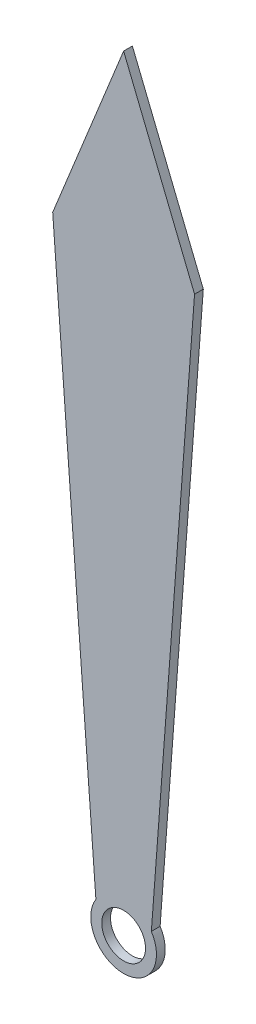
ISO-10303-21;
HEADER;
FILE_DESCRIPTION(('STEP AP214'),'2;1');
FILE_NAME('part.step','',(''),(''),'','','');
FILE_SCHEMA(('AUTOMOTIVE_DESIGN { 1 0 10303 214 1 1 1 1 }'));
ENDSEC;
DATA;
#1=APPLICATION_CONTEXT('core data for automotive mechanical design processes');
#2=APPLICATION_PROTOCOL_DEFINITION('international standard','automotive_design',2000,#1);
#3=PRODUCT_CONTEXT('',#1,'mechanical');
#4=PRODUCT('Part','Part','',(#3));
#5=PRODUCT_RELATED_PRODUCT_CATEGORY('part','',(#4));
#6=PRODUCT_DEFINITION_FORMATION('','',#4);
#7=PRODUCT_DEFINITION_CONTEXT('part definition',#1,'design');
#8=PRODUCT_DEFINITION('design','',#6,#7);
#9=PRODUCT_DEFINITION_SHAPE('','',#8);
#10=(LENGTH_UNIT() NAMED_UNIT(*) SI_UNIT(.MILLI.,.METRE.));
#11=(NAMED_UNIT(*) PLANE_ANGLE_UNIT() SI_UNIT($,.RADIAN.));
#12=(NAMED_UNIT(*) SI_UNIT($,.STERADIAN.) SOLID_ANGLE_UNIT());
#13=UNCERTAINTY_MEASURE_WITH_UNIT(LENGTH_MEASURE(1.E-05),#10,'distance_accuracy_value','');
#14=(GEOMETRIC_REPRESENTATION_CONTEXT(3) GLOBAL_UNCERTAINTY_ASSIGNED_CONTEXT((#13)) GLOBAL_UNIT_ASSIGNED_CONTEXT((#10,
#11,#12)) REPRESENTATION_CONTEXT('',''));
#15=CARTESIAN_POINT('',(0.,0.,0.));
#16=DIRECTION('',(0.,0.,1.));
#17=DIRECTION('',(1.,0.,0.));
#18=AXIS2_PLACEMENT_3D('',#15,#16,#17);
#19=CARTESIAN_POINT('',(-0.599989945600251,-0.0451892559447755,0.2));
#20=DIRECTION('',(-0.99717570835421,-0.0751039723868206,0.));
#21=DIRECTION('',(0.0751039723868206,-0.99717570835421,0.));
#22=AXIS2_PLACEMENT_3D('',#19,#20,#21);
#23=PLANE('',#22);
#24=DIRECTION('',(-0.0751039723868206,0.99717570835421,0.));
#25=VECTOR('',#24,1.);
#26=CARTESIAN_POINT('',(-0.599989945600251,-0.0451892559447755,0.));
#27=LINE('',#26,#25);
#28=CARTESIAN_POINT('',(-0.633616904993946,0.401284958235283,0.));
#29=VERTEX_POINT('',#28);
#30=CARTESIAN_POINT('',(-1.62016874792159,13.5,0.));
#31=VERTEX_POINT('',#30);
#32=EDGE_CURVE('E114',#29,#31,#27,.T.);
#33=ORIENTED_EDGE('',*,*,#32,.F.);
#34=DIRECTION('',(0.,0.,-1.));
#35=VECTOR('',#34,1.);
#36=CARTESIAN_POINT('',(-0.633616904993946,0.401284958235283,0.2));
#37=LINE('',#36,#35);
#38=CARTESIAN_POINT('',(-0.633616904993946,0.401284958235283,0.2));
#39=VERTEX_POINT('',#38);
#40=EDGE_CURVE('E11',#39,#29,#37,.T.);
#41=ORIENTED_EDGE('',*,*,#40,.F.);
#42=DIRECTION('',(-0.0751039723868206,0.99717570835421,0.));
#43=VECTOR('',#42,1.);
#44=CARTESIAN_POINT('',(-0.599989945600251,-0.0451892559447755,0.2));
#45=LINE('',#44,#43);
#46=CARTESIAN_POINT('',(-1.62016874792159,13.5,0.2));
#47=VERTEX_POINT('',#46);
#48=EDGE_CURVE('E127',#39,#47,#45,.T.);
#49=ORIENTED_EDGE('',*,*,#48,.T.);
#50=DIRECTION('',(0.,0.,-1.));
#51=VECTOR('',#50,1.);
#52=CARTESIAN_POINT('',(-1.62016874792159,13.5,0.2));
#53=LINE('',#52,#51);
#54=EDGE_CURVE('E52',#47,#31,#53,.T.);
#55=ORIENTED_EDGE('',*,*,#54,.T.);
#56=EDGE_LOOP('',(#33,#41,#49,#55));
#57=FACE_BOUND('',#56,.T.);
#58=ADVANCED_FACE('F36',(#57),#23,.T.);
#59=CARTESIAN_POINT('',(0.,0.,0.2));
#60=DIRECTION('',(0.,0.,-1.));
#61=DIRECTION('',(-1.,0.,0.));
#62=AXIS2_PLACEMENT_3D('',#59,#60,#61);
#63=CYLINDRICAL_SURFACE('',#62,0.75);
#64=CARTESIAN_POINT('',(0.,0.,0.));
#65=DIRECTION('',(0.,0.,1.));
#66=DIRECTION('',(1.,0.,0.));
#67=AXIS2_PLACEMENT_3D('',#64,#65,#66);
#68=CIRCLE('',#67,0.75);
#69=CARTESIAN_POINT('',(0.633616904993946,0.401284958235283,0.));
#70=VERTEX_POINT('',#69);
#71=EDGE_CURVE('E116',#29,#70,#68,.T.);
#72=ORIENTED_EDGE('',*,*,#71,.T.);
#73=DIRECTION('',(0.,0.,-1.));
#74=VECTOR('',#73,1.);
#75=CARTESIAN_POINT('',(0.633616904993946,0.401284958235283,0.2));
#76=LINE('',#75,#74);
#77=CARTESIAN_POINT('',(0.633616904993946,0.401284958235283,0.2));
#78=VERTEX_POINT('',#77);
#79=EDGE_CURVE('E44',#78,#70,#76,.T.);
#80=ORIENTED_EDGE('',*,*,#79,.F.);
#81=CARTESIAN_POINT('',(0.,0.,0.2));
#82=DIRECTION('',(0.,0.,1.));
#83=DIRECTION('',(1.,0.,0.));
#84=AXIS2_PLACEMENT_3D('',#81,#82,#83);
#85=CIRCLE('',#84,0.75);
#86=EDGE_CURVE('E92',#39,#78,#85,.T.);
#87=ORIENTED_EDGE('',*,*,#86,.F.);
#88=ORIENTED_EDGE('',*,*,#40,.T.);
#89=EDGE_LOOP('',(#72,#80,#87,#88));
#90=FACE_BOUND('',#89,.T.);
#91=ADVANCED_FACE('F147',(#90),#63,.T.);
#92=CARTESIAN_POINT('',(0.599989945600251,-0.0451892559447755,0.2));
#93=DIRECTION('',(-0.99717570835421,0.0751039723868206,0.));
#94=DIRECTION('',(-0.0751039723868206,-0.99717570835421,0.));
#95=AXIS2_PLACEMENT_3D('',#92,#93,#94);
#96=PLANE('',#95);
#97=DIRECTION('',(0.0751039723868206,0.99717570835421,0.));
#98=VECTOR('',#97,1.);
#99=CARTESIAN_POINT('',(0.599989945600251,-0.0451892559447755,0.));
#100=LINE('',#99,#98);
#101=CARTESIAN_POINT('',(1.62016874792159,13.5,0.));
#102=VERTEX_POINT('',#101);
#103=EDGE_CURVE('E101',#70,#102,#100,.T.);
#104=ORIENTED_EDGE('',*,*,#103,.T.);
#105=DIRECTION('',(0.,0.,-1.));
#106=VECTOR('',#105,1.);
#107=CARTESIAN_POINT('',(1.62016874792159,13.5,0.2));
#108=LINE('',#107,#106);
#109=CARTESIAN_POINT('',(1.62016874792159,13.5,0.2));
#110=VERTEX_POINT('',#109);
#111=EDGE_CURVE('E98',#110,#102,#108,.T.);
#112=ORIENTED_EDGE('',*,*,#111,.F.);
#113=DIRECTION('',(0.0751039723868206,0.99717570835421,0.));
#114=VECTOR('',#113,1.);
#115=CARTESIAN_POINT('',(0.599989945600251,-0.0451892559447755,0.2));
#116=LINE('',#115,#114);
#117=EDGE_CURVE('E84',#78,#110,#116,.T.);
#118=ORIENTED_EDGE('',*,*,#117,.F.);
#119=ORIENTED_EDGE('',*,*,#79,.T.);
#120=EDGE_LOOP('',(#104,#112,#118,#119));
#121=FACE_BOUND('',#120,.T.);
#122=ADVANCED_FACE('F99',(#121),#96,.F.);
#123=CARTESIAN_POINT('',(6.08924222680638,2.46639998859905,0.2));
#124=DIRECTION('',(-0.926856438610824,-0.375415958911792,0.));
#125=DIRECTION('',(0.375415958911792,-0.926856438610824,0.));
#126=AXIS2_PLACEMENT_3D('',#123,#124,#125);
#127=PLANE('',#126);
#128=DIRECTION('',(-0.375415958911792,0.926856438610824,0.));
#129=VECTOR('',#128,1.);
#130=CARTESIAN_POINT('',(6.08924222680638,2.46639998859905,0.));
#131=LINE('',#130,#129);
#132=CARTESIAN_POINT('',(0.,17.5,0.));
#133=VERTEX_POINT('',#132);
#134=EDGE_CURVE('E119',#102,#133,#131,.T.);
#135=ORIENTED_EDGE('',*,*,#134,.T.);
#136=DIRECTION('',(0.,0.,-1.));
#137=VECTOR('',#136,1.);
#138=CARTESIAN_POINT('',(0.,17.5,0.2));
#139=LINE('',#138,#137);
#140=CARTESIAN_POINT('',(0.,17.5,0.2));
#141=VERTEX_POINT('',#140);
#142=EDGE_CURVE('E69',#141,#133,#139,.T.);
#143=ORIENTED_EDGE('',*,*,#142,.F.);
#144=DIRECTION('',(-0.375415958911792,0.926856438610824,0.));
#145=VECTOR('',#144,1.);
#146=CARTESIAN_POINT('',(6.08924222680638,2.46639998859905,0.2));
#147=LINE('',#146,#145);
#148=EDGE_CURVE('E91',#110,#141,#147,.T.);
#149=ORIENTED_EDGE('',*,*,#148,.F.);
#150=ORIENTED_EDGE('',*,*,#111,.T.);
#151=EDGE_LOOP('',(#135,#143,#149,#150));
#152=FACE_BOUND('',#151,.T.);
#153=ADVANCED_FACE('F105',(#152),#127,.F.);
#154=CARTESIAN_POINT('',(-6.08924222680638,2.46639998859905,0.2));
#155=DIRECTION('',(-0.926856438610824,0.375415958911792,0.));
#156=DIRECTION('',(-0.375415958911792,-0.926856438610824,0.));
#157=AXIS2_PLACEMENT_3D('',#154,#155,#156);
#158=PLANE('',#157);
#159=DIRECTION('',(0.375415958911792,0.926856438610824,0.));
#160=VECTOR('',#159,1.);
#161=CARTESIAN_POINT('',(-6.08924222680638,2.46639998859905,0.));
#162=LINE('',#161,#160);
#163=EDGE_CURVE('E121',#31,#133,#162,.T.);
#164=ORIENTED_EDGE('',*,*,#163,.F.);
#165=ORIENTED_EDGE('',*,*,#54,.F.);
#166=DIRECTION('',(0.375415958911792,0.926856438610824,0.));
#167=VECTOR('',#166,1.);
#168=CARTESIAN_POINT('',(-6.08924222680638,2.46639998859905,0.2));
#169=LINE('',#168,#167);
#170=EDGE_CURVE('E106',#47,#141,#169,.T.);
#171=ORIENTED_EDGE('',*,*,#170,.T.);
#172=ORIENTED_EDGE('',*,*,#142,.T.);
#173=EDGE_LOOP('',(#164,#165,#171,#172));
#174=FACE_BOUND('',#173,.T.);
#175=ADVANCED_FACE('F134',(#174),#158,.T.);
#176=CARTESIAN_POINT('',(0.,0.,0.2));
#177=DIRECTION('',(0.,0.,-1.));
#178=DIRECTION('',(-1.,0.,0.));
#179=AXIS2_PLACEMENT_3D('',#176,#177,#178);
#180=CYLINDRICAL_SURFACE('',#179,0.5);
#181=CARTESIAN_POINT('',(0.,0.,0.2));
#182=DIRECTION('',(0.,0.,1.));
#183=DIRECTION('',(1.,0.,0.));
#184=AXIS2_PLACEMENT_3D('',#181,#182,#183);
#185=CIRCLE('',#184,0.5);
#186=CARTESIAN_POINT('',(0.5,0.,0.2));
#187=VERTEX_POINT('',#186);
#188=EDGE_CURVE('E108',#187,#187,#185,.T.);
#189=ORIENTED_EDGE('',*,*,#188,.T.);
#190=EDGE_LOOP('',(#189));
#191=FACE_BOUND('',#190,.T.);
#192=CARTESIAN_POINT('',(0.,0.,0.));
#193=DIRECTION('',(0.,0.,1.));
#194=DIRECTION('',(1.,0.,0.));
#195=AXIS2_PLACEMENT_3D('',#192,#193,#194);
#196=CIRCLE('',#195,0.5);
#197=CARTESIAN_POINT('',(0.5,0.,0.));
#198=VERTEX_POINT('',#197);
#199=EDGE_CURVE('E124',#198,#198,#196,.T.);
#200=ORIENTED_EDGE('',*,*,#199,.F.);
#201=EDGE_LOOP('',(#200));
#202=FACE_BOUND('',#201,.T.);
#203=ADVANCED_FACE('F136',(#191,#202),#180,.F.);
#204=CARTESIAN_POINT('',(0.,0.,0.2));
#205=DIRECTION('',(0.,0.,1.));
#206=DIRECTION('',(1.,0.,0.));
#207=AXIS2_PLACEMENT_3D('',#204,#205,#206);
#208=PLANE('',#207);
#209=ORIENTED_EDGE('',*,*,#48,.F.);
#210=ORIENTED_EDGE('',*,*,#86,.T.);
#211=ORIENTED_EDGE('',*,*,#117,.T.);
#212=ORIENTED_EDGE('',*,*,#148,.T.);
#213=ORIENTED_EDGE('',*,*,#170,.F.);
#214=EDGE_LOOP('',(#209,#210,#211,#212,#213));
#215=FACE_BOUND('',#214,.T.);
#216=ORIENTED_EDGE('',*,*,#188,.F.);
#217=EDGE_LOOP('',(#216));
#218=FACE_BOUND('',#217,.T.);
#219=ADVANCED_FACE('F87',(#215,#218),#208,.T.);
#220=CARTESIAN_POINT('',(0.,0.,0.));
#221=DIRECTION('',(0.,0.,1.));
#222=DIRECTION('',(1.,0.,0.));
#223=AXIS2_PLACEMENT_3D('',#220,#221,#222);
#224=PLANE('',#223);
#225=ORIENTED_EDGE('',*,*,#32,.T.);
#226=ORIENTED_EDGE('',*,*,#163,.T.);
#227=ORIENTED_EDGE('',*,*,#134,.F.);
#228=ORIENTED_EDGE('',*,*,#103,.F.);
#229=ORIENTED_EDGE('',*,*,#71,.F.);
#230=EDGE_LOOP('',(#225,#226,#227,#228,#229));
#231=FACE_BOUND('',#230,.T.);
#232=ORIENTED_EDGE('',*,*,#199,.T.);
#233=EDGE_LOOP('',(#232));
#234=FACE_BOUND('',#233,.T.);
#235=ADVANCED_FACE('F132',(#231,#234),#224,.F.);
#236=CLOSED_SHELL('',(#58,#91,#122,#153,#175,#203,#219,#235));
#237=MANIFOLD_SOLID_BREP('B2',#236);
#238=ADVANCED_BREP_SHAPE_REPRESENTATION('',(#18,#237),#14);
#239=SHAPE_DEFINITION_REPRESENTATION(#9,#238);
ENDSEC;
END-ISO-10303-21;
